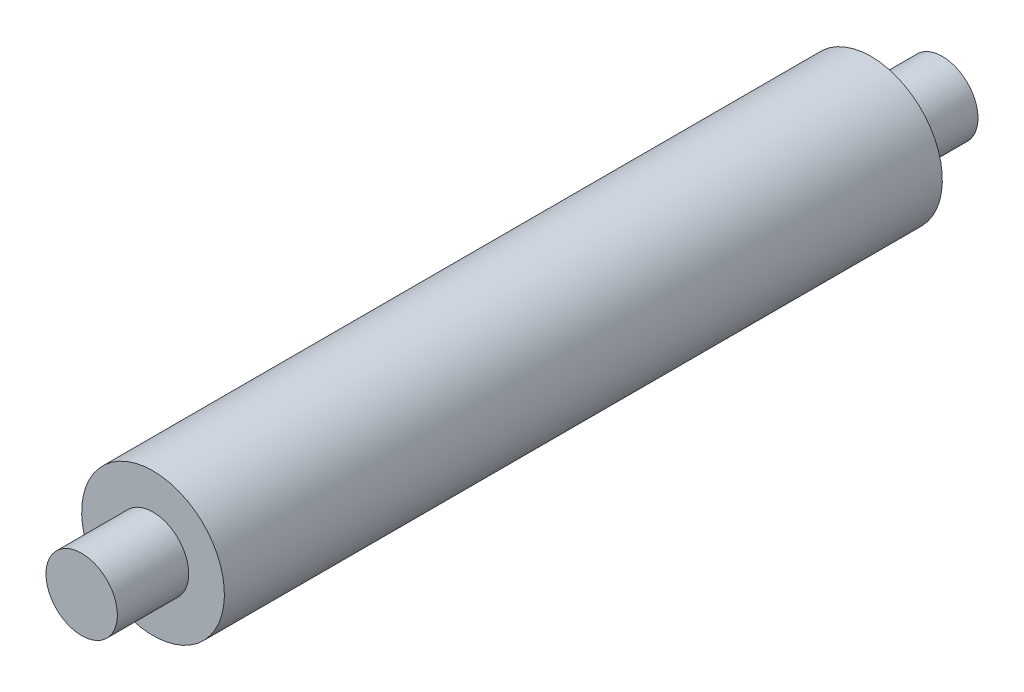
ISO-10303-21;
HEADER;
FILE_DESCRIPTION(('STEP AP214'),'2;1');
FILE_NAME('part.step','',(''),(''),'','','');
FILE_SCHEMA(('AUTOMOTIVE_DESIGN { 1 0 10303 214 1 1 1 1 }'));
ENDSEC;
DATA;
#1=APPLICATION_CONTEXT('core data for automotive mechanical design processes');
#2=APPLICATION_PROTOCOL_DEFINITION('international standard','automotive_design',2000,#1);
#3=PRODUCT_CONTEXT('',#1,'mechanical');
#4=PRODUCT('Part','Part','',(#3));
#5=PRODUCT_RELATED_PRODUCT_CATEGORY('part','',(#4));
#6=PRODUCT_DEFINITION_FORMATION('','',#4);
#7=PRODUCT_DEFINITION_CONTEXT('part definition',#1,'design');
#8=PRODUCT_DEFINITION('design','',#6,#7);
#9=PRODUCT_DEFINITION_SHAPE('','',#8);
#10=(LENGTH_UNIT() NAMED_UNIT(*) SI_UNIT(.MILLI.,.METRE.));
#11=(NAMED_UNIT(*) PLANE_ANGLE_UNIT() SI_UNIT($,.RADIAN.));
#12=(NAMED_UNIT(*) SI_UNIT($,.STERADIAN.) SOLID_ANGLE_UNIT());
#13=UNCERTAINTY_MEASURE_WITH_UNIT(LENGTH_MEASURE(1.E-05),#10,'distance_accuracy_value','');
#14=(GEOMETRIC_REPRESENTATION_CONTEXT(3) GLOBAL_UNCERTAINTY_ASSIGNED_CONTEXT((#13)) GLOBAL_UNIT_ASSIGNED_CONTEXT((#10,
#11,#12)) REPRESENTATION_CONTEXT('',''));
#15=CARTESIAN_POINT('',(0.,0.,0.));
#16=DIRECTION('',(0.,0.,1.));
#17=DIRECTION('',(1.,0.,0.));
#18=AXIS2_PLACEMENT_3D('',#15,#16,#17);
#19=CARTESIAN_POINT('',(0.,0.,140.462));
#20=DIRECTION('',(0.,0.,-1.));
#21=DIRECTION('',(0.,1.,0.));
#22=AXIS2_PLACEMENT_3D('',#19,#20,#21);
#23=PLANE('',#22);
#24=CARTESIAN_POINT('',(0.,0.,140.462));
#25=DIRECTION('',(0.,0.,-1.));
#26=DIRECTION('',(0.,1.,0.));
#27=AXIS2_PLACEMENT_3D('',#24,#25,#26);
#28=CIRCLE('',#27,6.35);
#29=CARTESIAN_POINT('',(0.,6.35000000000002,140.462));
#30=VERTEX_POINT('',#29);
#31=EDGE_CURVE('E54',#30,#30,#28,.T.);
#32=ORIENTED_EDGE('',*,*,#31,.F.);
#33=EDGE_LOOP('',(#32));
#34=FACE_BOUND('',#33,.T.);
#35=ADVANCED_FACE('F32',(#34),#23,.F.);
#36=CARTESIAN_POINT('',(0.,0.,-12.7));
#37=DIRECTION('',(0.,0.,-1.));
#38=DIRECTION('',(0.,1.,0.));
#39=AXIS2_PLACEMENT_3D('',#36,#37,#38);
#40=PLANE('',#39);
#41=CARTESIAN_POINT('',(0.,0.,-12.7));
#42=DIRECTION('',(0.,0.,-1.));
#43=DIRECTION('',(0.,1.,0.));
#44=AXIS2_PLACEMENT_3D('',#41,#42,#43);
#45=CIRCLE('',#44,6.35);
#46=CARTESIAN_POINT('',(0.,6.35,-12.7));
#47=VERTEX_POINT('',#46);
#48=EDGE_CURVE('E10',#47,#47,#45,.T.);
#49=ORIENTED_EDGE('',*,*,#48,.T.);
#50=EDGE_LOOP('',(#49));
#51=FACE_BOUND('',#50,.T.);
#52=ADVANCED_FACE('F62',(#51),#40,.T.);
#53=CARTESIAN_POINT('',(0.,0.,0.));
#54=DIRECTION('',(0.,0.,-1.));
#55=DIRECTION('',(0.,1.,0.));
#56=AXIS2_PLACEMENT_3D('',#53,#54,#55);
#57=CYLINDRICAL_SURFACE('',#56,6.35);
#58=ORIENTED_EDGE('',*,*,#48,.F.);
#59=EDGE_LOOP('',(#58));
#60=FACE_BOUND('',#59,.T.);
#61=CARTESIAN_POINT('',(0.,0.,0.));
#62=DIRECTION('',(0.,0.,-1.));
#63=DIRECTION('',(0.,1.,0.));
#64=AXIS2_PLACEMENT_3D('',#61,#62,#63);
#65=CIRCLE('',#64,6.35);
#66=CARTESIAN_POINT('',(0.,6.35,0.));
#67=VERTEX_POINT('',#66);
#68=EDGE_CURVE('E38',#67,#67,#65,.T.);
#69=ORIENTED_EDGE('',*,*,#68,.T.);
#70=EDGE_LOOP('',(#69));
#71=FACE_BOUND('',#70,.T.);
#72=ADVANCED_FACE('F66',(#60,#71),#57,.T.);
#73=CARTESIAN_POINT('',(0.,0.,0.));
#74=DIRECTION('',(0.,0.,-1.));
#75=DIRECTION('',(0.,1.,0.));
#76=AXIS2_PLACEMENT_3D('',#73,#74,#75);
#77=PLANE('',#76);
#78=CARTESIAN_POINT('',(0.,0.,0.));
#79=DIRECTION('',(0.,0.,-1.));
#80=DIRECTION('',(0.,1.,0.));
#81=AXIS2_PLACEMENT_3D('',#78,#79,#80);
#82=CIRCLE('',#81,12.7);
#83=CARTESIAN_POINT('',(0.,12.7,0.));
#84=VERTEX_POINT('',#83);
#85=EDGE_CURVE('E42',#84,#84,#82,.T.);
#86=ORIENTED_EDGE('',*,*,#85,.T.);
#87=EDGE_LOOP('',(#86));
#88=FACE_BOUND('',#87,.T.);
#89=ORIENTED_EDGE('',*,*,#68,.F.);
#90=EDGE_LOOP('',(#89));
#91=FACE_BOUND('',#90,.T.);
#92=ADVANCED_FACE('F70',(#88,#91),#77,.T.);
#93=CARTESIAN_POINT('',(0.,0.,0.));
#94=DIRECTION('',(0.,0.,-1.));
#95=DIRECTION('',(0.,1.,0.));
#96=AXIS2_PLACEMENT_3D('',#93,#94,#95);
#97=CYLINDRICAL_SURFACE('',#96,12.7);
#98=CARTESIAN_POINT('',(0.,0.,127.762));
#99=DIRECTION('',(0.,0.,-1.));
#100=DIRECTION('',(0.,1.,0.));
#101=AXIS2_PLACEMENT_3D('',#98,#99,#100);
#102=CIRCLE('',#101,12.7);
#103=CARTESIAN_POINT('',(0.,12.7,127.762));
#104=VERTEX_POINT('',#103);
#105=EDGE_CURVE('E46',#104,#104,#102,.T.);
#106=ORIENTED_EDGE('',*,*,#105,.T.);
#107=EDGE_LOOP('',(#106));
#108=FACE_BOUND('',#107,.T.);
#109=ORIENTED_EDGE('',*,*,#85,.F.);
#110=EDGE_LOOP('',(#109));
#111=FACE_BOUND('',#110,.T.);
#112=ADVANCED_FACE('F76',(#108,#111),#97,.T.);
#113=CARTESIAN_POINT('',(0.,0.,127.762));
#114=DIRECTION('',(0.,0.,-1.));
#115=DIRECTION('',(0.,1.,0.));
#116=AXIS2_PLACEMENT_3D('',#113,#114,#115);
#117=PLANE('',#116);
#118=ORIENTED_EDGE('',*,*,#105,.F.);
#119=EDGE_LOOP('',(#118));
#120=FACE_BOUND('',#119,.T.);
#121=CARTESIAN_POINT('',(0.,0.,127.762));
#122=DIRECTION('',(0.,0.,-1.));
#123=DIRECTION('',(0.,1.,0.));
#124=AXIS2_PLACEMENT_3D('',#121,#122,#123);
#125=CIRCLE('',#124,6.34999999999999);
#126=CARTESIAN_POINT('',(0.,6.35000000000001,127.762));
#127=VERTEX_POINT('',#126);
#128=EDGE_CURVE('E51',#127,#127,#125,.T.);
#129=ORIENTED_EDGE('',*,*,#128,.T.);
#130=EDGE_LOOP('',(#129));
#131=FACE_BOUND('',#130,.T.);
#132=ADVANCED_FACE('F80',(#120,#131),#117,.F.);
#133=CARTESIAN_POINT('',(0.,0.,0.));
#134=DIRECTION('',(0.,0.,-1.));
#135=DIRECTION('',(0.,1.,0.));
#136=AXIS2_PLACEMENT_3D('',#133,#134,#135);
#137=CYLINDRICAL_SURFACE('',#136,6.35);
#138=ORIENTED_EDGE('',*,*,#31,.T.);
#139=EDGE_LOOP('',(#138));
#140=FACE_BOUND('',#139,.T.);
#141=ORIENTED_EDGE('',*,*,#128,.F.);
#142=EDGE_LOOP('',(#141));
#143=FACE_BOUND('',#142,.T.);
#144=ADVANCED_FACE('F58',(#140,#143),#137,.T.);
#145=CLOSED_SHELL('',(#35,#52,#72,#92,#112,#132,#144));
#146=MANIFOLD_SOLID_BREP('B2',#145);
#147=ADVANCED_BREP_SHAPE_REPRESENTATION('',(#18,#146),#14);
#148=SHAPE_DEFINITION_REPRESENTATION(#9,#147);
ENDSEC;
END-ISO-10303-21;
